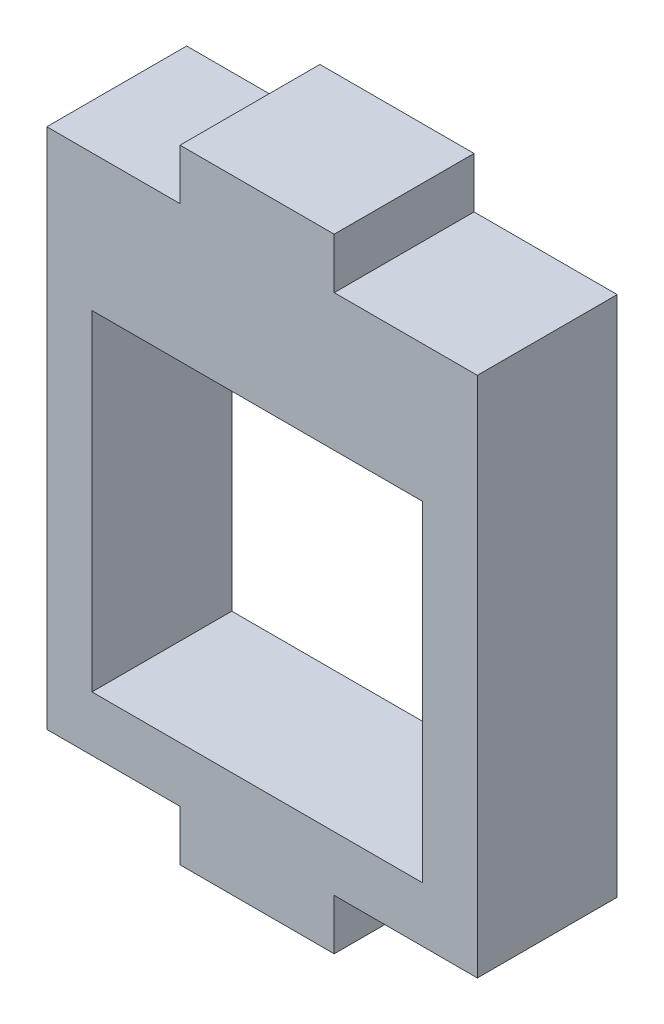
ISO-10303-21;
HEADER;
FILE_DESCRIPTION(('STEP AP214'),'2;1');
FILE_NAME('part.step','',(''),(''),'','','');
FILE_SCHEMA(('AUTOMOTIVE_DESIGN { 1 0 10303 214 1 1 1 1 }'));
ENDSEC;
DATA;
#1=APPLICATION_CONTEXT('core data for automotive mechanical design processes');
#2=APPLICATION_PROTOCOL_DEFINITION('international standard','automotive_design',2000,#1);
#3=PRODUCT_CONTEXT('',#1,'mechanical');
#4=PRODUCT('Part','Part','',(#3));
#5=PRODUCT_RELATED_PRODUCT_CATEGORY('part','',(#4));
#6=PRODUCT_DEFINITION_FORMATION('','',#4);
#7=PRODUCT_DEFINITION_CONTEXT('part definition',#1,'design');
#8=PRODUCT_DEFINITION('design','',#6,#7);
#9=PRODUCT_DEFINITION_SHAPE('','',#8);
#10=(LENGTH_UNIT() NAMED_UNIT(*) SI_UNIT(.MILLI.,.METRE.));
#11=(NAMED_UNIT(*) PLANE_ANGLE_UNIT() SI_UNIT($,.RADIAN.));
#12=(NAMED_UNIT(*) SI_UNIT($,.STERADIAN.) SOLID_ANGLE_UNIT());
#13=UNCERTAINTY_MEASURE_WITH_UNIT(LENGTH_MEASURE(1.E-05),#10,'distance_accuracy_value','');
#14=(GEOMETRIC_REPRESENTATION_CONTEXT(3) GLOBAL_UNCERTAINTY_ASSIGNED_CONTEXT((#13)) GLOBAL_UNIT_ASSIGNED_CONTEXT((#10,
#11,#12)) REPRESENTATION_CONTEXT('',''));
#15=CARTESIAN_POINT('',(0.,0.,0.));
#16=DIRECTION('',(0.,0.,1.));
#17=DIRECTION('',(1.,0.,0.));
#18=AXIS2_PLACEMENT_3D('',#15,#16,#17);
#19=CARTESIAN_POINT('',(2.26470070803342,0.383619426620352,6.35));
#20=DIRECTION('',(0.,1.,0.));
#21=DIRECTION('',(-1.,0.,0.));
#22=AXIS2_PLACEMENT_3D('',#19,#20,#21);
#23=PLANE('',#22);
#24=DIRECTION('',(0.,0.,1.));
#25=VECTOR('',#24,1.);
#26=CARTESIAN_POINT('',(-4.23529929196658,0.383619426620351,0.));
#27=LINE('',#26,#25);
#28=CARTESIAN_POINT('',(-4.23529929196658,0.383619426620351,0.));
#29=VERTEX_POINT('',#28);
#30=CARTESIAN_POINT('',(-4.23529929196658,0.383619426620351,6.35));
#31=VERTEX_POINT('',#30);
#32=EDGE_CURVE('E333',#29,#31,#27,.T.);
#33=ORIENTED_EDGE('',*,*,#32,.F.);
#34=DIRECTION('',(1.,0.,0.));
#35=VECTOR('',#34,1.);
#36=CARTESIAN_POINT('',(2.26470070803342,0.383619426620352,0.));
#37=LINE('',#36,#35);
#38=CARTESIAN_POINT('',(2.26470070803342,0.383619426620352,0.));
#39=VERTEX_POINT('',#38);
#40=EDGE_CURVE('E195',#29,#39,#37,.T.);
#41=ORIENTED_EDGE('',*,*,#40,.T.);
#42=DIRECTION('',(0.,0.,-1.));
#43=VECTOR('',#42,1.);
#44=CARTESIAN_POINT('',(2.26470070803342,0.383619426620352,6.35));
#45=LINE('',#44,#43);
#46=CARTESIAN_POINT('',(2.26470070803342,0.383619426620352,6.35));
#47=VERTEX_POINT('',#46);
#48=EDGE_CURVE('E47',#47,#39,#45,.T.);
#49=ORIENTED_EDGE('',*,*,#48,.F.);
#50=DIRECTION('',(1.,0.,0.));
#51=VECTOR('',#50,1.);
#52=CARTESIAN_POINT('',(2.26470070803342,0.383619426620352,6.35));
#53=LINE('',#52,#51);
#54=EDGE_CURVE('E171',#31,#47,#53,.T.);
#55=ORIENTED_EDGE('',*,*,#54,.F.);
#56=EDGE_LOOP('',(#33,#41,#49,#55));
#57=FACE_BOUND('',#56,.T.);
#58=ADVANCED_FACE('F38',(#57),#23,.F.);
#59=CARTESIAN_POINT('',(-17.2852992919666,0.383619426620351,6.35));
#60=VERTEX_POINT('',#59);
#61=CARTESIAN_POINT('',(-11.2352992919666,0.383619426620351,6.35));
#62=VERTEX_POINT('',#61);
#63=EDGE_CURVE('E60',#60,#62,#53,.T.);
#64=ORIENTED_EDGE('',*,*,#63,.F.);
#65=DIRECTION('',(0.,0.,1.));
#66=VECTOR('',#65,1.);
#67=CARTESIAN_POINT('',(-17.2852992919666,0.383619426620351,-3.65));
#68=LINE('',#67,#66);
#69=CARTESIAN_POINT('',(-17.2852992919666,0.383619426620351,0.));
#70=VERTEX_POINT('',#69);
#71=EDGE_CURVE('E150',#70,#60,#68,.T.);
#72=ORIENTED_EDGE('',*,*,#71,.F.);
#73=CARTESIAN_POINT('',(-11.2352992919666,0.383619426620351,0.));
#74=VERTEX_POINT('',#73);
#75=EDGE_CURVE('E191',#70,#74,#37,.T.);
#76=ORIENTED_EDGE('',*,*,#75,.T.);
#77=DIRECTION('',(0.,0.,1.));
#78=VECTOR('',#77,1.);
#79=CARTESIAN_POINT('',(-11.2352992919666,0.383619426620351,0.));
#80=LINE('',#79,#78);
#81=EDGE_CURVE('E168',#74,#62,#80,.T.);
#82=ORIENTED_EDGE('',*,*,#81,.T.);
#83=EDGE_LOOP('',(#64,#72,#76,#82));
#84=FACE_BOUND('',#83,.T.);
#85=ADVANCED_FACE('F40',(#84),#23,.F.);
#86=CARTESIAN_POINT('',(2.26470070803342,17.8836194266204,6.35));
#87=DIRECTION('',(-1.,0.,0.));
#88=DIRECTION('',(0.,-1.,0.));
#89=AXIS2_PLACEMENT_3D('',#86,#87,#88);
#90=PLANE('',#89);
#91=DIRECTION('',(0.,1.,0.));
#92=VECTOR('',#91,1.);
#93=CARTESIAN_POINT('',(2.26470070803342,17.8836194266204,0.));
#94=LINE('',#93,#92);
#95=CARTESIAN_POINT('',(2.26470070803342,24.0836194266204,0.));
#96=VERTEX_POINT('',#95);
#97=EDGE_CURVE('E194',#39,#96,#94,.T.);
#98=ORIENTED_EDGE('',*,*,#97,.T.);
#99=DIRECTION('',(0.,0.,1.));
#100=VECTOR('',#99,1.);
#101=CARTESIAN_POINT('',(2.26470070803342,24.0836194266204,0.));
#102=LINE('',#101,#100);
#103=CARTESIAN_POINT('',(2.26470070803342,24.0836194266204,6.35));
#104=VERTEX_POINT('',#103);
#105=EDGE_CURVE('E267',#96,#104,#102,.T.);
#106=ORIENTED_EDGE('',*,*,#105,.T.);
#107=DIRECTION('',(0.,1.,0.));
#108=VECTOR('',#107,1.);
#109=CARTESIAN_POINT('',(2.26470070803342,17.8836194266204,6.35));
#110=LINE('',#109,#108);
#111=EDGE_CURVE('E170',#47,#104,#110,.T.);
#112=ORIENTED_EDGE('',*,*,#111,.F.);
#113=ORIENTED_EDGE('',*,*,#48,.T.);
#114=EDGE_LOOP('',(#98,#106,#112,#113));
#115=FACE_BOUND('',#114,.T.);
#116=ADVANCED_FACE('F226',(#115),#90,.F.);
#117=CARTESIAN_POINT('',(-0.235299291966581,2.88361942662035,6.35));
#118=DIRECTION('',(1.,0.,0.));
#119=DIRECTION('',(0.,0.,-1.));
#120=AXIS2_PLACEMENT_3D('',#117,#118,#119);
#121=PLANE('',#120);
#122=DIRECTION('',(0.,-1.,0.));
#123=VECTOR('',#122,1.);
#124=CARTESIAN_POINT('',(-0.235299291966581,2.88361942662035,0.));
#125=LINE('',#124,#123);
#126=CARTESIAN_POINT('',(-0.235299291966581,17.8836194266204,0.));
#127=VERTEX_POINT('',#126);
#128=CARTESIAN_POINT('',(-0.235299291966581,2.88361942662035,0.));
#129=VERTEX_POINT('',#128);
#130=EDGE_CURVE('E198',#127,#129,#125,.T.);
#131=ORIENTED_EDGE('',*,*,#130,.T.);
#132=DIRECTION('',(0.,0.,-1.));
#133=VECTOR('',#132,1.);
#134=CARTESIAN_POINT('',(-0.235299291966581,2.88361942662035,6.35));
#135=LINE('',#134,#133);
#136=CARTESIAN_POINT('',(-0.235299291966581,2.88361942662035,6.35));
#137=VERTEX_POINT('',#136);
#138=EDGE_CURVE('E213',#137,#129,#135,.T.);
#139=ORIENTED_EDGE('',*,*,#138,.F.);
#140=DIRECTION('',(0.,-1.,0.));
#141=VECTOR('',#140,1.);
#142=CARTESIAN_POINT('',(-0.235299291966581,2.88361942662035,6.35));
#143=LINE('',#142,#141);
#144=CARTESIAN_POINT('',(-0.235299291966581,17.8836194266204,6.35));
#145=VERTEX_POINT('',#144);
#146=EDGE_CURVE('E175',#145,#137,#143,.T.);
#147=ORIENTED_EDGE('',*,*,#146,.F.);
#148=DIRECTION('',(0.,0.,-1.));
#149=VECTOR('',#148,1.);
#150=CARTESIAN_POINT('',(-0.235299291966581,17.8836194266204,6.35));
#151=LINE('',#150,#149);
#152=EDGE_CURVE('E217',#145,#127,#151,.T.);
#153=ORIENTED_EDGE('',*,*,#152,.T.);
#154=EDGE_LOOP('',(#131,#139,#147,#153));
#155=FACE_BOUND('',#154,.T.);
#156=ADVANCED_FACE('F311',(#155),#121,.F.);
#157=CARTESIAN_POINT('',(-15.2352992919666,2.88361942662035,6.35));
#158=DIRECTION('',(0.,-1.,0.));
#159=DIRECTION('',(1.,0.,0.));
#160=AXIS2_PLACEMENT_3D('',#157,#158,#159);
#161=PLANE('',#160);
#162=DIRECTION('',(-1.,0.,0.));
#163=VECTOR('',#162,1.);
#164=CARTESIAN_POINT('',(-15.2352992919666,2.88361942662035,0.));
#165=LINE('',#164,#163);
#166=CARTESIAN_POINT('',(-15.2352992919666,2.88361942662035,0.));
#167=VERTEX_POINT('',#166);
#168=EDGE_CURVE('E201',#129,#167,#165,.T.);
#169=ORIENTED_EDGE('',*,*,#168,.T.);
#170=DIRECTION('',(0.,0.,-1.));
#171=VECTOR('',#170,1.);
#172=CARTESIAN_POINT('',(-15.2352992919666,2.88361942662035,6.35));
#173=LINE('',#172,#171);
#174=CARTESIAN_POINT('',(-15.2352992919666,2.88361942662035,6.35));
#175=VERTEX_POINT('',#174);
#176=EDGE_CURVE('E209',#175,#167,#173,.T.);
#177=ORIENTED_EDGE('',*,*,#176,.F.);
#178=DIRECTION('',(-1.,0.,0.));
#179=VECTOR('',#178,1.);
#180=CARTESIAN_POINT('',(-15.2352992919666,2.88361942662035,6.35));
#181=LINE('',#180,#179);
#182=EDGE_CURVE('E184',#137,#175,#181,.T.);
#183=ORIENTED_EDGE('',*,*,#182,.F.);
#184=ORIENTED_EDGE('',*,*,#138,.T.);
#185=EDGE_LOOP('',(#169,#177,#183,#184));
#186=FACE_BOUND('',#185,.T.);
#187=ADVANCED_FACE('F316',(#186),#161,.F.);
#188=CARTESIAN_POINT('',(-15.2352992919666,17.8836194266204,6.35));
#189=DIRECTION('',(-1.,0.,0.));
#190=DIRECTION('',(0.,-1.,0.));
#191=AXIS2_PLACEMENT_3D('',#188,#189,#190);
#192=PLANE('',#191);
#193=DIRECTION('',(0.,1.,0.));
#194=VECTOR('',#193,1.);
#195=CARTESIAN_POINT('',(-15.2352992919666,17.8836194266204,0.));
#196=LINE('',#195,#194);
#197=CARTESIAN_POINT('',(-15.2352992919666,17.8836194266204,0.));
#198=VERTEX_POINT('',#197);
#199=EDGE_CURVE('E177',#167,#198,#196,.T.);
#200=ORIENTED_EDGE('',*,*,#199,.T.);
#201=DIRECTION('',(0.,0.,-1.));
#202=VECTOR('',#201,1.);
#203=CARTESIAN_POINT('',(-15.2352992919666,17.8836194266204,6.35));
#204=LINE('',#203,#202);
#205=CARTESIAN_POINT('',(-15.2352992919666,17.8836194266204,6.35));
#206=VERTEX_POINT('',#205);
#207=EDGE_CURVE('E190',#206,#198,#204,.T.);
#208=ORIENTED_EDGE('',*,*,#207,.F.);
#209=DIRECTION('',(0.,1.,0.));
#210=VECTOR('',#209,1.);
#211=CARTESIAN_POINT('',(-15.2352992919666,17.8836194266204,6.35));
#212=LINE('',#211,#210);
#213=EDGE_CURVE('E187',#175,#206,#212,.T.);
#214=ORIENTED_EDGE('',*,*,#213,.F.);
#215=ORIENTED_EDGE('',*,*,#176,.T.);
#216=EDGE_LOOP('',(#200,#208,#214,#215));
#217=FACE_BOUND('',#216,.T.);
#218=ADVANCED_FACE('F318',(#217),#192,.F.);
#219=CARTESIAN_POINT('',(0.,0.,6.35));
#220=DIRECTION('',(0.,0.,-1.));
#221=DIRECTION('',(-1.,0.,0.));
#222=AXIS2_PLACEMENT_3D('',#219,#220,#221);
#223=PLANE('',#222);
#224=DIRECTION('',(-1.,0.,0.));
#225=VECTOR('',#224,1.);
#226=CARTESIAN_POINT('',(-17.7352992919666,24.0836194266204,6.35));
#227=LINE('',#226,#225);
#228=CARTESIAN_POINT('',(-11.2352992919666,24.0836194266204,6.35));
#229=VERTEX_POINT('',#228);
#230=CARTESIAN_POINT('',(-17.2852992919666,24.0836194266204,6.35));
#231=VERTEX_POINT('',#230);
#232=EDGE_CURVE('E163',#229,#231,#227,.T.);
#233=ORIENTED_EDGE('',*,*,#232,.T.);
#234=DIRECTION('',(0.,1.,0.));
#235=VECTOR('',#234,1.);
#236=CARTESIAN_POINT('',(-17.2852992919666,24.0836194266204,6.35));
#237=LINE('',#236,#235);
#238=EDGE_CURVE('E53',#60,#231,#237,.T.);
#239=ORIENTED_EDGE('',*,*,#238,.F.);
#240=ORIENTED_EDGE('',*,*,#63,.T.);
#241=DIRECTION('',(0.,-1.,0.));
#242=VECTOR('',#241,1.);
#243=CARTESIAN_POINT('',(-11.2352992919666,0.383619426620351,6.35));
#244=LINE('',#243,#242);
#245=CARTESIAN_POINT('',(-11.2352992919666,-1.91638057337965,6.35));
#246=VERTEX_POINT('',#245);
#247=EDGE_CURVE('E352',#62,#246,#244,.T.);
#248=ORIENTED_EDGE('',*,*,#247,.T.);
#249=DIRECTION('',(1.,0.,0.));
#250=VECTOR('',#249,1.);
#251=CARTESIAN_POINT('',(-11.2352992919666,-1.91638057337965,6.35));
#252=LINE('',#251,#250);
#253=CARTESIAN_POINT('',(-4.23529929196658,-1.91638057337965,6.35));
#254=VERTEX_POINT('',#253);
#255=EDGE_CURVE('E348',#246,#254,#252,.T.);
#256=ORIENTED_EDGE('',*,*,#255,.T.);
#257=DIRECTION('',(0.,1.,0.));
#258=VECTOR('',#257,1.);
#259=CARTESIAN_POINT('',(-4.23529929196658,0.383619426620351,6.35));
#260=LINE('',#259,#258);
#261=EDGE_CURVE('E344',#254,#31,#260,.T.);
#262=ORIENTED_EDGE('',*,*,#261,.T.);
#263=ORIENTED_EDGE('',*,*,#54,.T.);
#264=ORIENTED_EDGE('',*,*,#111,.T.);
#265=DIRECTION('',(-1.,0.,0.));
#266=VECTOR('',#265,1.);
#267=CARTESIAN_POINT('',(-4.23529929196658,24.0836194266204,6.35));
#268=LINE('',#267,#266);
#269=CARTESIAN_POINT('',(-4.23529929196658,24.0836194266204,6.35));
#270=VERTEX_POINT('',#269);
#271=EDGE_CURVE('E268',#104,#270,#268,.T.);
#272=ORIENTED_EDGE('',*,*,#271,.T.);
#273=DIRECTION('',(0.,1.,0.));
#274=VECTOR('',#273,1.);
#275=CARTESIAN_POINT('',(-4.23529929196658,24.0836194266204,6.35));
#276=LINE('',#275,#274);
#277=CARTESIAN_POINT('',(-4.23529929196658,26.3836194266203,6.35));
#278=VERTEX_POINT('',#277);
#279=EDGE_CURVE('E272',#270,#278,#276,.T.);
#280=ORIENTED_EDGE('',*,*,#279,.T.);
#281=DIRECTION('',(-1.,0.,0.));
#282=VECTOR('',#281,1.);
#283=CARTESIAN_POINT('',(-11.2352992919666,26.3836194266203,6.35));
#284=LINE('',#283,#282);
#285=CARTESIAN_POINT('',(-11.2352992919666,26.3836194266203,6.35));
#286=VERTEX_POINT('',#285);
#287=EDGE_CURVE('E276',#278,#286,#284,.T.);
#288=ORIENTED_EDGE('',*,*,#287,.T.);
#289=DIRECTION('',(0.,-1.,0.));
#290=VECTOR('',#289,1.);
#291=CARTESIAN_POINT('',(-11.2352992919666,24.0836194266204,6.35));
#292=LINE('',#291,#290);
#293=EDGE_CURVE('E250',#286,#229,#292,.T.);
#294=ORIENTED_EDGE('',*,*,#293,.T.);
#295=EDGE_LOOP('',(#233,#239,#240,#248,#256,#262,#263,#264,#272,#280,#288,#294));
#296=FACE_BOUND('',#295,.T.);
#297=ORIENTED_EDGE('',*,*,#213,.T.);
#298=DIRECTION('',(1.,0.,0.));
#299=VECTOR('',#298,1.);
#300=CARTESIAN_POINT('',(-17.7352992919666,17.8836194266204,6.35));
#301=LINE('',#300,#299);
#302=EDGE_CURVE('E295',#206,#145,#301,.T.);
#303=ORIENTED_EDGE('',*,*,#302,.T.);
#304=ORIENTED_EDGE('',*,*,#146,.T.);
#305=ORIENTED_EDGE('',*,*,#182,.T.);
#306=EDGE_LOOP('',(#297,#303,#304,#305));
#307=FACE_BOUND('',#306,.T.);
#308=ADVANCED_FACE('F159',(#296,#307),#223,.F.);
#309=CARTESIAN_POINT('',(0.,0.,0.));
#310=DIRECTION('',(0.,0.,-1.));
#311=DIRECTION('',(-1.,0.,0.));
#312=AXIS2_PLACEMENT_3D('',#309,#310,#311);
#313=PLANE('',#312);
#314=DIRECTION('',(0.,-1.,0.));
#315=VECTOR('',#314,1.);
#316=CARTESIAN_POINT('',(-17.2852992919666,0.,0.));
#317=LINE('',#316,#315);
#318=CARTESIAN_POINT('',(-17.2852992919666,24.0836194266204,0.));
#319=VERTEX_POINT('',#318);
#320=EDGE_CURVE('E153',#319,#70,#317,.T.);
#321=ORIENTED_EDGE('',*,*,#320,.F.);
#322=DIRECTION('',(-1.,0.,0.));
#323=VECTOR('',#322,1.);
#324=CARTESIAN_POINT('',(-17.7352992919666,24.0836194266204,0.));
#325=LINE('',#324,#323);
#326=CARTESIAN_POINT('',(-11.2352992919666,24.0836194266204,0.));
#327=VERTEX_POINT('',#326);
#328=EDGE_CURVE('E263',#327,#319,#325,.T.);
#329=ORIENTED_EDGE('',*,*,#328,.F.);
#330=DIRECTION('',(0.,-1.,0.));
#331=VECTOR('',#330,1.);
#332=CARTESIAN_POINT('',(-11.2352992919666,24.0836194266204,0.));
#333=LINE('',#332,#331);
#334=CARTESIAN_POINT('',(-11.2352992919666,26.3836194266203,0.));
#335=VERTEX_POINT('',#334);
#336=EDGE_CURVE('E259',#335,#327,#333,.T.);
#337=ORIENTED_EDGE('',*,*,#336,.F.);
#338=DIRECTION('',(-1.,0.,0.));
#339=VECTOR('',#338,1.);
#340=CARTESIAN_POINT('',(-11.2352992919666,26.3836194266203,0.));
#341=LINE('',#340,#339);
#342=CARTESIAN_POINT('',(-4.23529929196658,26.3836194266203,0.));
#343=VERTEX_POINT('',#342);
#344=EDGE_CURVE('E248',#343,#335,#341,.T.);
#345=ORIENTED_EDGE('',*,*,#344,.F.);
#346=DIRECTION('',(0.,1.,0.));
#347=VECTOR('',#346,1.);
#348=CARTESIAN_POINT('',(-4.23529929196658,24.0836194266204,0.));
#349=LINE('',#348,#347);
#350=CARTESIAN_POINT('',(-4.23529929196658,24.0836194266204,0.));
#351=VERTEX_POINT('',#350);
#352=EDGE_CURVE('E242',#351,#343,#349,.T.);
#353=ORIENTED_EDGE('',*,*,#352,.F.);
#354=DIRECTION('',(-1.,0.,0.));
#355=VECTOR('',#354,1.);
#356=CARTESIAN_POINT('',(-4.23529929196658,24.0836194266204,0.));
#357=LINE('',#356,#355);
#358=EDGE_CURVE('E239',#96,#351,#357,.T.);
#359=ORIENTED_EDGE('',*,*,#358,.F.);
#360=ORIENTED_EDGE('',*,*,#97,.F.);
#361=ORIENTED_EDGE('',*,*,#40,.F.);
#362=DIRECTION('',(0.,1.,0.));
#363=VECTOR('',#362,1.);
#364=CARTESIAN_POINT('',(-4.23529929196658,0.383619426620351,0.));
#365=LINE('',#364,#363);
#366=CARTESIAN_POINT('',(-4.23529929196658,-1.91638057337965,0.));
#367=VERTEX_POINT('',#366);
#368=EDGE_CURVE('E355',#367,#29,#365,.T.);
#369=ORIENTED_EDGE('',*,*,#368,.F.);
#370=DIRECTION('',(1.,0.,0.));
#371=VECTOR('',#370,1.);
#372=CARTESIAN_POINT('',(-11.2352992919666,-1.91638057337965,0.));
#373=LINE('',#372,#371);
#374=CARTESIAN_POINT('',(-11.2352992919666,-1.91638057337965,0.));
#375=VERTEX_POINT('',#374);
#376=EDGE_CURVE('E358',#375,#367,#373,.T.);
#377=ORIENTED_EDGE('',*,*,#376,.F.);
#378=DIRECTION('',(0.,-1.,0.));
#379=VECTOR('',#378,1.);
#380=CARTESIAN_POINT('',(-11.2352992919666,0.383619426620351,0.));
#381=LINE('',#380,#379);
#382=EDGE_CURVE('E347',#74,#375,#381,.T.);
#383=ORIENTED_EDGE('',*,*,#382,.F.);
#384=ORIENTED_EDGE('',*,*,#75,.F.);
#385=EDGE_LOOP('',(#321,#329,#337,#345,#353,#359,#360,#361,#369,#377,#383,#384));
#386=FACE_BOUND('',#385,.T.);
#387=DIRECTION('',(1.,0.,0.));
#388=VECTOR('',#387,1.);
#389=CARTESIAN_POINT('',(-17.7352992919666,17.8836194266204,0.));
#390=LINE('',#389,#388);
#391=EDGE_CURVE('E179',#198,#127,#390,.T.);
#392=ORIENTED_EDGE('',*,*,#391,.F.);
#393=ORIENTED_EDGE('',*,*,#199,.F.);
#394=ORIENTED_EDGE('',*,*,#168,.F.);
#395=ORIENTED_EDGE('',*,*,#130,.F.);
#396=EDGE_LOOP('',(#392,#393,#394,#395));
#397=FACE_BOUND('',#396,.T.);
#398=ADVANCED_FACE('F234',(#386,#397),#313,.T.);
#399=CARTESIAN_POINT('',(-17.7352992919666,17.8836194266204,6.35));
#400=DIRECTION('',(0.,1.,0.));
#401=DIRECTION('',(0.,0.,1.));
#402=AXIS2_PLACEMENT_3D('',#399,#400,#401);
#403=PLANE('',#402);
#404=ORIENTED_EDGE('',*,*,#391,.T.);
#405=ORIENTED_EDGE('',*,*,#152,.F.);
#406=ORIENTED_EDGE('',*,*,#302,.F.);
#407=ORIENTED_EDGE('',*,*,#207,.T.);
#408=EDGE_LOOP('',(#404,#405,#406,#407));
#409=FACE_BOUND('',#408,.T.);
#410=ADVANCED_FACE('F305',(#409),#403,.F.);
#411=CARTESIAN_POINT('',(-17.7352992919666,24.0836194266204,0.));
#412=DIRECTION('',(0.,1.,0.));
#413=DIRECTION('',(0.,0.,1.));
#414=AXIS2_PLACEMENT_3D('',#411,#412,#413);
#415=PLANE('',#414);
#416=DIRECTION('',(0.,0.,-1.));
#417=VECTOR('',#416,1.);
#418=CARTESIAN_POINT('',(-17.2852992919666,24.0836194266204,0.));
#419=LINE('',#418,#417);
#420=EDGE_CURVE('E11',#231,#319,#419,.T.);
#421=ORIENTED_EDGE('',*,*,#420,.F.);
#422=ORIENTED_EDGE('',*,*,#232,.F.);
#423=DIRECTION('',(0.,0.,1.));
#424=VECTOR('',#423,1.);
#425=CARTESIAN_POINT('',(-11.2352992919666,24.0836194266204,0.));
#426=LINE('',#425,#424);
#427=EDGE_CURVE('E282',#327,#229,#426,.T.);
#428=ORIENTED_EDGE('',*,*,#427,.F.);
#429=ORIENTED_EDGE('',*,*,#328,.T.);
#430=EDGE_LOOP('',(#421,#422,#428,#429));
#431=FACE_BOUND('',#430,.T.);
#432=ADVANCED_FACE('F378',(#431),#415,.T.);
#433=CARTESIAN_POINT('',(-11.2352992919666,24.0836194266204,0.));
#434=DIRECTION('',(-1.,0.,0.));
#435=DIRECTION('',(0.,0.,1.));
#436=AXIS2_PLACEMENT_3D('',#433,#434,#435);
#437=PLANE('',#436);
#438=ORIENTED_EDGE('',*,*,#293,.F.);
#439=DIRECTION('',(0.,0.,1.));
#440=VECTOR('',#439,1.);
#441=CARTESIAN_POINT('',(-11.2352992919666,26.3836194266203,0.));
#442=LINE('',#441,#440);
#443=EDGE_CURVE('E285',#335,#286,#442,.T.);
#444=ORIENTED_EDGE('',*,*,#443,.F.);
#445=ORIENTED_EDGE('',*,*,#336,.T.);
#446=ORIENTED_EDGE('',*,*,#427,.T.);
#447=EDGE_LOOP('',(#438,#444,#445,#446));
#448=FACE_BOUND('',#447,.T.);
#449=ADVANCED_FACE('F381',(#448),#437,.T.);
#450=CARTESIAN_POINT('',(-11.2352992919666,26.3836194266203,0.));
#451=DIRECTION('',(0.,1.,0.));
#452=DIRECTION('',(0.,0.,1.));
#453=AXIS2_PLACEMENT_3D('',#450,#451,#452);
#454=PLANE('',#453);
#455=ORIENTED_EDGE('',*,*,#287,.F.);
#456=DIRECTION('',(0.,0.,1.));
#457=VECTOR('',#456,1.);
#458=CARTESIAN_POINT('',(-4.23529929196658,26.3836194266203,0.));
#459=LINE('',#458,#457);
#460=EDGE_CURVE('E288',#343,#278,#459,.T.);
#461=ORIENTED_EDGE('',*,*,#460,.F.);
#462=ORIENTED_EDGE('',*,*,#344,.T.);
#463=ORIENTED_EDGE('',*,*,#443,.T.);
#464=EDGE_LOOP('',(#455,#461,#462,#463));
#465=FACE_BOUND('',#464,.T.);
#466=ADVANCED_FACE('F384',(#465),#454,.T.);
#467=CARTESIAN_POINT('',(-4.23529929196658,24.0836194266204,0.));
#468=DIRECTION('',(1.,0.,0.));
#469=DIRECTION('',(0.,0.,-1.));
#470=AXIS2_PLACEMENT_3D('',#467,#468,#469);
#471=PLANE('',#470);
#472=ORIENTED_EDGE('',*,*,#279,.F.);
#473=DIRECTION('',(0.,0.,1.));
#474=VECTOR('',#473,1.);
#475=CARTESIAN_POINT('',(-4.23529929196658,24.0836194266204,0.));
#476=LINE('',#475,#474);
#477=EDGE_CURVE('E291',#351,#270,#476,.T.);
#478=ORIENTED_EDGE('',*,*,#477,.F.);
#479=ORIENTED_EDGE('',*,*,#352,.T.);
#480=ORIENTED_EDGE('',*,*,#460,.T.);
#481=EDGE_LOOP('',(#472,#478,#479,#480));
#482=FACE_BOUND('',#481,.T.);
#483=ADVANCED_FACE('F387',(#482),#471,.T.);
#484=CARTESIAN_POINT('',(-4.23529929196658,24.0836194266204,0.));
#485=DIRECTION('',(0.,1.,0.));
#486=DIRECTION('',(0.,0.,1.));
#487=AXIS2_PLACEMENT_3D('',#484,#485,#486);
#488=PLANE('',#487);
#489=ORIENTED_EDGE('',*,*,#271,.F.);
#490=ORIENTED_EDGE('',*,*,#105,.F.);
#491=ORIENTED_EDGE('',*,*,#358,.T.);
#492=ORIENTED_EDGE('',*,*,#477,.T.);
#493=EDGE_LOOP('',(#489,#490,#491,#492));
#494=FACE_BOUND('',#493,.T.);
#495=ADVANCED_FACE('F389',(#494),#488,.T.);
#496=CARTESIAN_POINT('',(-11.2352992919666,0.383619426620351,0.));
#497=DIRECTION('',(-1.,0.,0.));
#498=DIRECTION('',(0.,0.,1.));
#499=AXIS2_PLACEMENT_3D('',#496,#497,#498);
#500=PLANE('',#499);
#501=ORIENTED_EDGE('',*,*,#247,.F.);
#502=ORIENTED_EDGE('',*,*,#81,.F.);
#503=ORIENTED_EDGE('',*,*,#382,.T.);
#504=DIRECTION('',(0.,0.,1.));
#505=VECTOR('',#504,1.);
#506=CARTESIAN_POINT('',(-11.2352992919666,-1.91638057337965,0.));
#507=LINE('',#506,#505);
#508=EDGE_CURVE('E253',#375,#246,#507,.T.);
#509=ORIENTED_EDGE('',*,*,#508,.T.);
#510=EDGE_LOOP('',(#501,#502,#503,#509));
#511=FACE_BOUND('',#510,.T.);
#512=ADVANCED_FACE('F369',(#511),#500,.T.);
#513=CARTESIAN_POINT('',(-4.23529929196658,0.383619426620351,0.));
#514=DIRECTION('',(1.,0.,0.));
#515=DIRECTION('',(0.,0.,-1.));
#516=AXIS2_PLACEMENT_3D('',#513,#514,#515);
#517=PLANE('',#516);
#518=ORIENTED_EDGE('',*,*,#261,.F.);
#519=DIRECTION('',(0.,0.,1.));
#520=VECTOR('',#519,1.);
#521=CARTESIAN_POINT('',(-4.23529929196658,-1.91638057337965,0.));
#522=LINE('',#521,#520);
#523=EDGE_CURVE('E338',#367,#254,#522,.T.);
#524=ORIENTED_EDGE('',*,*,#523,.F.);
#525=ORIENTED_EDGE('',*,*,#368,.T.);
#526=ORIENTED_EDGE('',*,*,#32,.T.);
#527=EDGE_LOOP('',(#518,#524,#525,#526));
#528=FACE_BOUND('',#527,.T.);
#529=ADVANCED_FACE('F374',(#528),#517,.T.);
#530=CARTESIAN_POINT('',(-11.2352992919666,-1.91638057337965,0.));
#531=DIRECTION('',(0.,-1.,0.));
#532=DIRECTION('',(0.,0.,-1.));
#533=AXIS2_PLACEMENT_3D('',#530,#531,#532);
#534=PLANE('',#533);
#535=ORIENTED_EDGE('',*,*,#255,.F.);
#536=ORIENTED_EDGE('',*,*,#508,.F.);
#537=ORIENTED_EDGE('',*,*,#376,.T.);
#538=ORIENTED_EDGE('',*,*,#523,.T.);
#539=EDGE_LOOP('',(#535,#536,#537,#538));
#540=FACE_BOUND('',#539,.T.);
#541=ADVANCED_FACE('F373',(#540),#534,.T.);
#542=CARTESIAN_POINT('',(-17.2852992919666,24.0836194266204,-3.65));
#543=DIRECTION('',(1.,0.,0.));
#544=DIRECTION('',(0.,1.,0.));
#545=AXIS2_PLACEMENT_3D('',#542,#543,#544);
#546=PLANE('',#545);
#547=ORIENTED_EDGE('',*,*,#320,.T.);
#548=ORIENTED_EDGE('',*,*,#71,.T.);
#549=ORIENTED_EDGE('',*,*,#238,.T.);
#550=ORIENTED_EDGE('',*,*,#420,.T.);
#551=EDGE_LOOP('',(#547,#548,#549,#550));
#552=FACE_BOUND('',#551,.T.);
#553=ADVANCED_FACE('F151',(#552),#546,.F.);
#554=CLOSED_SHELL('',(#58,#85,#116,#156,#187,#218,#308,#398,#410,#432,#449,#466,#483,#495,#512,
#529,#541,#553));
#555=MANIFOLD_SOLID_BREP('B2',#554);
#556=ADVANCED_BREP_SHAPE_REPRESENTATION('',(#18,#555),#14);
#557=SHAPE_DEFINITION_REPRESENTATION(#9,#556);
ENDSEC;
END-ISO-10303-21;
